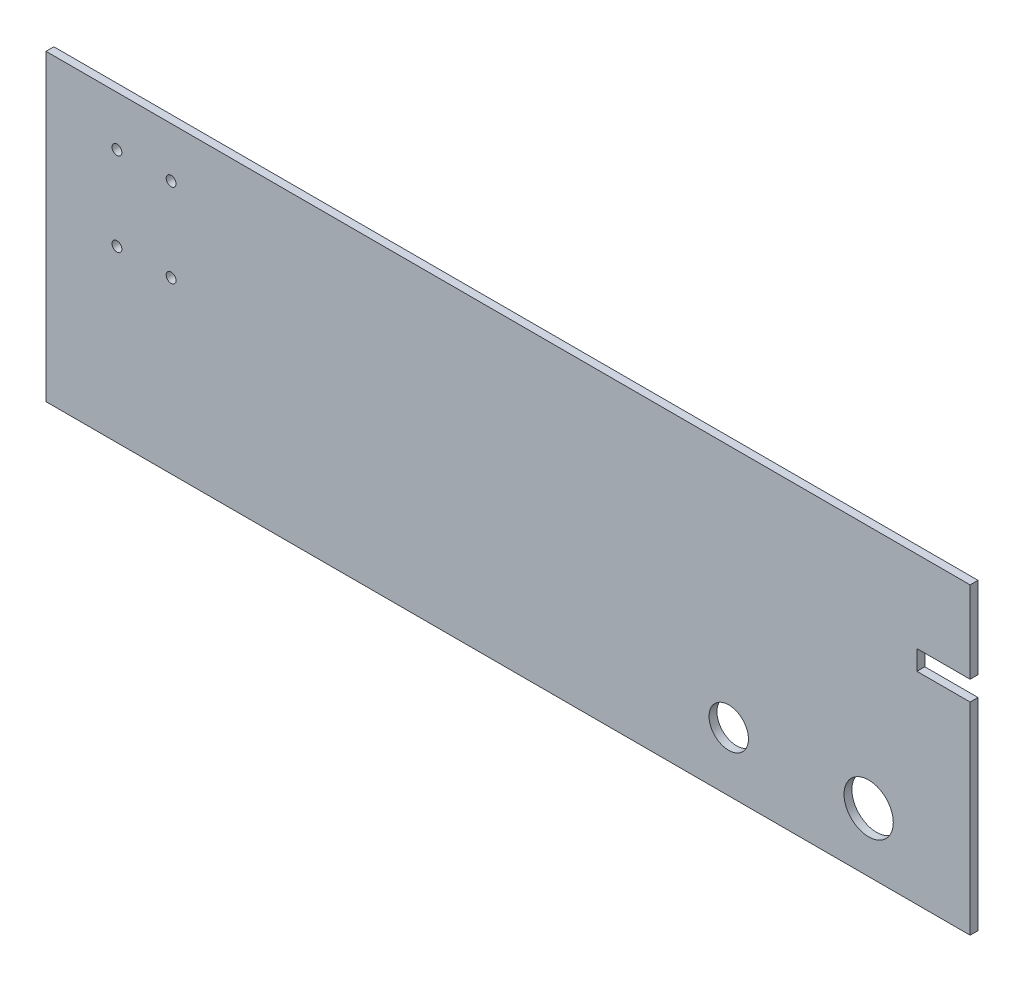
ISO-10303-21;
HEADER;
FILE_DESCRIPTION(('STEP AP214'),'2;1');
FILE_NAME('part.step','',(''),(''),'','','');
FILE_SCHEMA(('AUTOMOTIVE_DESIGN { 1 0 10303 214 1 1 1 1 }'));
ENDSEC;
DATA;
#1=APPLICATION_CONTEXT('core data for automotive mechanical design processes');
#2=APPLICATION_PROTOCOL_DEFINITION('international standard','automotive_design',2000,#1);
#3=PRODUCT_CONTEXT('',#1,'mechanical');
#4=PRODUCT('Part','Part','',(#3));
#5=PRODUCT_RELATED_PRODUCT_CATEGORY('part','',(#4));
#6=PRODUCT_DEFINITION_FORMATION('','',#4);
#7=PRODUCT_DEFINITION_CONTEXT('part definition',#1,'design');
#8=PRODUCT_DEFINITION('design','',#6,#7);
#9=PRODUCT_DEFINITION_SHAPE('','',#8);
#10=(LENGTH_UNIT() NAMED_UNIT(*) SI_UNIT(.MILLI.,.METRE.));
#11=(NAMED_UNIT(*) PLANE_ANGLE_UNIT() SI_UNIT($,.RADIAN.));
#12=(NAMED_UNIT(*) SI_UNIT($,.STERADIAN.) SOLID_ANGLE_UNIT());
#13=UNCERTAINTY_MEASURE_WITH_UNIT(LENGTH_MEASURE(1.E-05),#10,'distance_accuracy_value','');
#14=(GEOMETRIC_REPRESENTATION_CONTEXT(3) GLOBAL_UNCERTAINTY_ASSIGNED_CONTEXT((#13)) GLOBAL_UNIT_ASSIGNED_CONTEXT((#10,
#11,#12)) REPRESENTATION_CONTEXT('',''));
#15=CARTESIAN_POINT('',(0.,0.,0.));
#16=DIRECTION('',(0.,0.,1.));
#17=DIRECTION('',(1.,0.,0.));
#18=AXIS2_PLACEMENT_3D('',#15,#16,#17);
#19=CARTESIAN_POINT('',(-693.,248.,-8.));
#20=DIRECTION('',(-1.,0.,0.));
#21=DIRECTION('',(0.,0.,1.));
#22=AXIS2_PLACEMENT_3D('',#19,#20,#21);
#23=PLANE('',#22);
#24=DIRECTION('',(0.,-1.,0.));
#25=VECTOR('',#24,1.);
#26=CARTESIAN_POINT('',(-693.,248.,0.));
#27=LINE('',#26,#25);
#28=CARTESIAN_POINT('',(-693.,248.,0.));
#29=VERTEX_POINT('',#28);
#30=CARTESIAN_POINT('',(-693.,-60.,0.));
#31=VERTEX_POINT('',#30);
#32=EDGE_CURVE('E99',#29,#31,#27,.T.);
#33=ORIENTED_EDGE('',*,*,#32,.F.);
#34=DIRECTION('',(0.,0.,1.));
#35=VECTOR('',#34,1.);
#36=CARTESIAN_POINT('',(-693.,248.,-8.));
#37=LINE('',#36,#35);
#38=CARTESIAN_POINT('',(-693.,248.,-8.));
#39=VERTEX_POINT('',#38);
#40=EDGE_CURVE('E11',#39,#29,#37,.T.);
#41=ORIENTED_EDGE('',*,*,#40,.F.);
#42=DIRECTION('',(0.,-1.,0.));
#43=VECTOR('',#42,1.);
#44=CARTESIAN_POINT('',(-693.,248.,-8.));
#45=LINE('',#44,#43);
#46=CARTESIAN_POINT('',(-693.,-60.,-8.));
#47=VERTEX_POINT('',#46);
#48=EDGE_CURVE('E101',#39,#47,#45,.T.);
#49=ORIENTED_EDGE('',*,*,#48,.T.);
#50=DIRECTION('',(0.,0.,1.));
#51=VECTOR('',#50,1.);
#52=CARTESIAN_POINT('',(-693.,-60.,-8.));
#53=LINE('',#52,#51);
#54=EDGE_CURVE('E38',#47,#31,#53,.T.);
#55=ORIENTED_EDGE('',*,*,#54,.T.);
#56=EDGE_LOOP('',(#33,#41,#49,#55));
#57=FACE_BOUND('',#56,.T.);
#58=ADVANCED_FACE('F35',(#57),#23,.T.);
#59=CARTESIAN_POINT('',(-693.,248.,-8.));
#60=DIRECTION('',(0.,1.,0.));
#61=DIRECTION('',(0.,0.,1.));
#62=AXIS2_PLACEMENT_3D('',#59,#60,#61);
#63=PLANE('',#62);
#64=DIRECTION('',(-1.,0.,0.));
#65=VECTOR('',#64,1.);
#66=CARTESIAN_POINT('',(-693.,248.,0.));
#67=LINE('',#66,#65);
#68=CARTESIAN_POINT('',(245.,248.,0.));
#69=VERTEX_POINT('',#68);
#70=EDGE_CURVE('E118',#69,#29,#67,.T.);
#71=ORIENTED_EDGE('',*,*,#70,.F.);
#72=DIRECTION('',(0.,0.,1.));
#73=VECTOR('',#72,1.);
#74=CARTESIAN_POINT('',(245.,248.,-8.));
#75=LINE('',#74,#73);
#76=CARTESIAN_POINT('',(245.,248.,-8.));
#77=VERTEX_POINT('',#76);
#78=EDGE_CURVE('E43',#77,#69,#75,.T.);
#79=ORIENTED_EDGE('',*,*,#78,.F.);
#80=DIRECTION('',(-1.,0.,0.));
#81=VECTOR('',#80,1.);
#82=CARTESIAN_POINT('',(-693.,248.,-8.));
#83=LINE('',#82,#81);
#84=EDGE_CURVE('E106',#77,#39,#83,.T.);
#85=ORIENTED_EDGE('',*,*,#84,.T.);
#86=ORIENTED_EDGE('',*,*,#40,.T.);
#87=EDGE_LOOP('',(#71,#79,#85,#86));
#88=FACE_BOUND('',#87,.T.);
#89=ADVANCED_FACE('F184',(#88),#63,.T.);
#90=CARTESIAN_POINT('',(245.,248.,-8.));
#91=DIRECTION('',(1.,0.,0.));
#92=DIRECTION('',(0.,0.,-1.));
#93=AXIS2_PLACEMENT_3D('',#90,#91,#92);
#94=PLANE('',#93);
#95=DIRECTION('',(0.,1.,0.));
#96=VECTOR('',#95,1.);
#97=CARTESIAN_POINT('',(245.,248.,0.));
#98=LINE('',#97,#96);
#99=CARTESIAN_POINT('',(245.,165.,0.));
#100=VERTEX_POINT('',#99);
#101=EDGE_CURVE('E136',#100,#69,#98,.T.);
#102=ORIENTED_EDGE('',*,*,#101,.F.);
#103=DIRECTION('',(0.,0.,1.));
#104=VECTOR('',#103,1.);
#105=CARTESIAN_POINT('',(245.,165.,-8.));
#106=LINE('',#105,#104);
#107=CARTESIAN_POINT('',(245.,165.,-8.));
#108=VERTEX_POINT('',#107);
#109=EDGE_CURVE('E158',#108,#100,#106,.T.);
#110=ORIENTED_EDGE('',*,*,#109,.F.);
#111=DIRECTION('',(0.,1.,0.));
#112=VECTOR('',#111,1.);
#113=CARTESIAN_POINT('',(245.,248.,-8.));
#114=LINE('',#113,#112);
#115=EDGE_CURVE('E154',#108,#77,#114,.T.);
#116=ORIENTED_EDGE('',*,*,#115,.T.);
#117=ORIENTED_EDGE('',*,*,#78,.T.);
#118=EDGE_LOOP('',(#102,#110,#116,#117));
#119=FACE_BOUND('',#118,.T.);
#120=ADVANCED_FACE('F183',(#119),#94,.T.);
#121=CARTESIAN_POINT('',(245.,165.,-8.));
#122=DIRECTION('',(0.,-1.,0.));
#123=DIRECTION('',(0.,0.,-1.));
#124=AXIS2_PLACEMENT_3D('',#121,#122,#123);
#125=PLANE('',#124);
#126=DIRECTION('',(1.,0.,0.));
#127=VECTOR('',#126,1.);
#128=CARTESIAN_POINT('',(245.,165.,0.));
#129=LINE('',#128,#127);
#130=CARTESIAN_POINT('',(191.,165.,0.));
#131=VERTEX_POINT('',#130);
#132=EDGE_CURVE('E133',#131,#100,#129,.T.);
#133=ORIENTED_EDGE('',*,*,#132,.F.);
#134=DIRECTION('',(0.,0.,1.));
#135=VECTOR('',#134,1.);
#136=CARTESIAN_POINT('',(191.,165.,-8.));
#137=LINE('',#136,#135);
#138=CARTESIAN_POINT('',(191.,165.,-8.));
#139=VERTEX_POINT('',#138);
#140=EDGE_CURVE('E160',#139,#131,#137,.T.);
#141=ORIENTED_EDGE('',*,*,#140,.F.);
#142=DIRECTION('',(1.,0.,0.));
#143=VECTOR('',#142,1.);
#144=CARTESIAN_POINT('',(245.,165.,-8.));
#145=LINE('',#144,#143);
#146=EDGE_CURVE('E151',#139,#108,#145,.T.);
#147=ORIENTED_EDGE('',*,*,#146,.T.);
#148=ORIENTED_EDGE('',*,*,#109,.T.);
#149=EDGE_LOOP('',(#133,#141,#147,#148));
#150=FACE_BOUND('',#149,.T.);
#151=ADVANCED_FACE('F179',(#150),#125,.T.);
#152=CARTESIAN_POINT('',(191.,165.,-8.));
#153=DIRECTION('',(1.,0.,0.));
#154=DIRECTION('',(0.,0.,-1.));
#155=AXIS2_PLACEMENT_3D('',#152,#153,#154);
#156=PLANE('',#155);
#157=DIRECTION('',(0.,1.,0.));
#158=VECTOR('',#157,1.);
#159=CARTESIAN_POINT('',(191.,165.,0.));
#160=LINE('',#159,#158);
#161=CARTESIAN_POINT('',(191.,145.,0.));
#162=VERTEX_POINT('',#161);
#163=EDGE_CURVE('E130',#162,#131,#160,.T.);
#164=ORIENTED_EDGE('',*,*,#163,.F.);
#165=DIRECTION('',(0.,0.,1.));
#166=VECTOR('',#165,1.);
#167=CARTESIAN_POINT('',(191.,145.,-8.));
#168=LINE('',#167,#166);
#169=CARTESIAN_POINT('',(191.,145.,-8.));
#170=VERTEX_POINT('',#169);
#171=EDGE_CURVE('E162',#170,#162,#168,.T.);
#172=ORIENTED_EDGE('',*,*,#171,.F.);
#173=DIRECTION('',(0.,1.,0.));
#174=VECTOR('',#173,1.);
#175=CARTESIAN_POINT('',(191.,165.,-8.));
#176=LINE('',#175,#174);
#177=EDGE_CURVE('E148',#170,#139,#176,.T.);
#178=ORIENTED_EDGE('',*,*,#177,.T.);
#179=ORIENTED_EDGE('',*,*,#140,.T.);
#180=EDGE_LOOP('',(#164,#172,#178,#179));
#181=FACE_BOUND('',#180,.T.);
#182=ADVANCED_FACE('F175',(#181),#156,.T.);
#183=CARTESIAN_POINT('',(245.,145.,-8.));
#184=DIRECTION('',(0.,1.,0.));
#185=DIRECTION('',(0.,0.,1.));
#186=AXIS2_PLACEMENT_3D('',#183,#184,#185);
#187=PLANE('',#186);
#188=DIRECTION('',(-1.,0.,0.));
#189=VECTOR('',#188,1.);
#190=CARTESIAN_POINT('',(245.,145.,0.));
#191=LINE('',#190,#189);
#192=CARTESIAN_POINT('',(245.,145.,0.));
#193=VERTEX_POINT('',#192);
#194=EDGE_CURVE('E127',#193,#162,#191,.T.);
#195=ORIENTED_EDGE('',*,*,#194,.F.);
#196=DIRECTION('',(0.,0.,1.));
#197=VECTOR('',#196,1.);
#198=CARTESIAN_POINT('',(245.,145.,-8.));
#199=LINE('',#198,#197);
#200=CARTESIAN_POINT('',(245.,145.,-8.));
#201=VERTEX_POINT('',#200);
#202=EDGE_CURVE('E164',#201,#193,#199,.T.);
#203=ORIENTED_EDGE('',*,*,#202,.F.);
#204=DIRECTION('',(-1.,0.,0.));
#205=VECTOR('',#204,1.);
#206=CARTESIAN_POINT('',(245.,145.,-8.));
#207=LINE('',#206,#205);
#208=EDGE_CURVE('E145',#201,#170,#207,.T.);
#209=ORIENTED_EDGE('',*,*,#208,.T.);
#210=ORIENTED_EDGE('',*,*,#171,.T.);
#211=EDGE_LOOP('',(#195,#203,#209,#210));
#212=FACE_BOUND('',#211,.T.);
#213=ADVANCED_FACE('F171',(#212),#187,.T.);
#214=CARTESIAN_POINT('',(245.,145.,-8.));
#215=DIRECTION('',(1.,0.,0.));
#216=DIRECTION('',(0.,0.,-1.));
#217=AXIS2_PLACEMENT_3D('',#214,#215,#216);
#218=PLANE('',#217);
#219=DIRECTION('',(0.,1.,0.));
#220=VECTOR('',#219,1.);
#221=CARTESIAN_POINT('',(245.,145.,0.));
#222=LINE('',#221,#220);
#223=CARTESIAN_POINT('',(245.,-60.,0.));
#224=VERTEX_POINT('',#223);
#225=EDGE_CURVE('E114',#224,#193,#222,.T.);
#226=ORIENTED_EDGE('',*,*,#225,.F.);
#227=DIRECTION('',(0.,0.,1.));
#228=VECTOR('',#227,1.);
#229=CARTESIAN_POINT('',(245.,-60.,-8.));
#230=LINE('',#229,#228);
#231=CARTESIAN_POINT('',(245.,-60.,-8.));
#232=VERTEX_POINT('',#231);
#233=EDGE_CURVE('E105',#232,#224,#230,.T.);
#234=ORIENTED_EDGE('',*,*,#233,.F.);
#235=DIRECTION('',(0.,1.,0.));
#236=VECTOR('',#235,1.);
#237=CARTESIAN_POINT('',(245.,145.,-8.));
#238=LINE('',#237,#236);
#239=EDGE_CURVE('E142',#232,#201,#238,.T.);
#240=ORIENTED_EDGE('',*,*,#239,.T.);
#241=ORIENTED_EDGE('',*,*,#202,.T.);
#242=EDGE_LOOP('',(#226,#234,#240,#241));
#243=FACE_BOUND('',#242,.T.);
#244=ADVANCED_FACE('F167',(#243),#218,.T.);
#245=CARTESIAN_POINT('',(-693.,-60.,-8.));
#246=DIRECTION('',(0.,-1.,0.));
#247=DIRECTION('',(0.,0.,-1.));
#248=AXIS2_PLACEMENT_3D('',#245,#246,#247);
#249=PLANE('',#248);
#250=DIRECTION('',(1.,0.,0.));
#251=VECTOR('',#250,1.);
#252=CARTESIAN_POINT('',(-693.,-60.,0.));
#253=LINE('',#252,#251);
#254=EDGE_CURVE('E108',#31,#224,#253,.T.);
#255=ORIENTED_EDGE('',*,*,#254,.F.);
#256=ORIENTED_EDGE('',*,*,#54,.F.);
#257=DIRECTION('',(1.,0.,0.));
#258=VECTOR('',#257,1.);
#259=CARTESIAN_POINT('',(-693.,-60.,-8.));
#260=LINE('',#259,#258);
#261=EDGE_CURVE('E140',#47,#232,#260,.T.);
#262=ORIENTED_EDGE('',*,*,#261,.T.);
#263=ORIENTED_EDGE('',*,*,#233,.T.);
#264=EDGE_LOOP('',(#255,#256,#262,#263));
#265=FACE_BOUND('',#264,.T.);
#266=ADVANCED_FACE('F109',(#265),#249,.T.);
#267=CARTESIAN_POINT('',(-693.,-60.,-8.));
#268=DIRECTION('',(0.,0.,1.));
#269=DIRECTION('',(1.,0.,0.));
#270=AXIS2_PLACEMENT_3D('',#267,#268,#269);
#271=PLANE('',#270);
#272=CARTESIAN_POINT('',(142.,0.,-8.));
#273=DIRECTION('',(0.,0.,1.));
#274=DIRECTION('',(1.,0.,0.));
#275=AXIS2_PLACEMENT_3D('',#272,#273,#274);
#276=CIRCLE('',#275,25.);
#277=CARTESIAN_POINT('',(167.,0.,-8.));
#278=VERTEX_POINT('',#277);
#279=EDGE_CURVE('E300',#278,#278,#276,.T.);
#280=ORIENTED_EDGE('',*,*,#279,.T.);
#281=EDGE_LOOP('',(#280));
#282=FACE_BOUND('',#281,.T.);
#283=CARTESIAN_POINT('',(-621.,112.5,-8.));
#284=DIRECTION('',(0.,0.,1.));
#285=DIRECTION('',(-1.,0.,0.));
#286=AXIS2_PLACEMENT_3D('',#283,#284,#285);
#287=CIRCLE('',#286,5.00000000000005);
#288=CARTESIAN_POINT('',(-626.,112.5,-8.));
#289=VERTEX_POINT('',#288);
#290=EDGE_CURVE('E310',#289,#289,#287,.T.);
#291=ORIENTED_EDGE('',*,*,#290,.T.);
#292=EDGE_LOOP('',(#291));
#293=FACE_BOUND('',#292,.T.);
#294=CARTESIAN_POINT('',(-566.,112.5,-8.));
#295=DIRECTION('',(0.,0.,1.));
#296=DIRECTION('',(1.,0.,0.));
#297=AXIS2_PLACEMENT_3D('',#294,#295,#296);
#298=CIRCLE('',#297,5.00000000000005);
#299=CARTESIAN_POINT('',(-561.,112.5,-8.));
#300=VERTEX_POINT('',#299);
#301=EDGE_CURVE('E316',#300,#300,#298,.T.);
#302=ORIENTED_EDGE('',*,*,#301,.T.);
#303=EDGE_LOOP('',(#302));
#304=FACE_BOUND('',#303,.T.);
#305=CARTESIAN_POINT('',(-566.,197.5,-8.));
#306=DIRECTION('',(0.,0.,1.));
#307=DIRECTION('',(-1.,0.,0.));
#308=AXIS2_PLACEMENT_3D('',#305,#306,#307);
#309=CIRCLE('',#308,5.00000000000005);
#310=CARTESIAN_POINT('',(-571.,197.5,-8.));
#311=VERTEX_POINT('',#310);
#312=EDGE_CURVE('E322',#311,#311,#309,.T.);
#313=ORIENTED_EDGE('',*,*,#312,.T.);
#314=EDGE_LOOP('',(#313));
#315=FACE_BOUND('',#314,.T.);
#316=CARTESIAN_POINT('',(-621.,197.5,-8.));
#317=DIRECTION('',(0.,0.,1.));
#318=DIRECTION('',(1.,0.,0.));
#319=AXIS2_PLACEMENT_3D('',#316,#317,#318);
#320=CIRCLE('',#319,5.00000000000005);
#321=CARTESIAN_POINT('',(-616.,197.5,-8.));
#322=VERTEX_POINT('',#321);
#323=EDGE_CURVE('E328',#322,#322,#320,.T.);
#324=ORIENTED_EDGE('',*,*,#323,.T.);
#325=EDGE_LOOP('',(#324));
#326=FACE_BOUND('',#325,.T.);
#327=CARTESIAN_POINT('',(0.,0.,-8.));
#328=DIRECTION('',(0.,0.,1.));
#329=DIRECTION('',(1.,0.,0.));
#330=AXIS2_PLACEMENT_3D('',#327,#328,#329);
#331=CIRCLE('',#330,20.);
#332=CARTESIAN_POINT('',(20.,0.,-8.));
#333=VERTEX_POINT('',#332);
#334=EDGE_CURVE('E119',#333,#333,#331,.T.);
#335=ORIENTED_EDGE('',*,*,#334,.T.);
#336=EDGE_LOOP('',(#335));
#337=FACE_BOUND('',#336,.T.);
#338=ORIENTED_EDGE('',*,*,#48,.F.);
#339=ORIENTED_EDGE('',*,*,#84,.F.);
#340=ORIENTED_EDGE('',*,*,#115,.F.);
#341=ORIENTED_EDGE('',*,*,#146,.F.);
#342=ORIENTED_EDGE('',*,*,#177,.F.);
#343=ORIENTED_EDGE('',*,*,#208,.F.);
#344=ORIENTED_EDGE('',*,*,#239,.F.);
#345=ORIENTED_EDGE('',*,*,#261,.F.);
#346=EDGE_LOOP('',(#338,#339,#340,#341,#342,#343,#344,#345));
#347=FACE_BOUND('',#346,.T.);
#348=ADVANCED_FACE('F187',(#282,#293,#304,#315,#326,#337,#347),#271,.F.);
#349=CARTESIAN_POINT('',(-693.,-60.,0.));
#350=DIRECTION('',(0.,0.,1.));
#351=DIRECTION('',(1.,0.,0.));
#352=AXIS2_PLACEMENT_3D('',#349,#350,#351);
#353=PLANE('',#352);
#354=CARTESIAN_POINT('',(142.,0.,0.));
#355=DIRECTION('',(0.,0.,1.));
#356=DIRECTION('',(1.,0.,0.));
#357=AXIS2_PLACEMENT_3D('',#354,#355,#356);
#358=CIRCLE('',#357,25.);
#359=CARTESIAN_POINT('',(167.,0.,0.));
#360=VERTEX_POINT('',#359);
#361=EDGE_CURVE('E303',#360,#360,#358,.T.);
#362=ORIENTED_EDGE('',*,*,#361,.F.);
#363=EDGE_LOOP('',(#362));
#364=FACE_BOUND('',#363,.T.);
#365=CARTESIAN_POINT('',(-621.,112.5,0.));
#366=DIRECTION('',(0.,0.,1.));
#367=DIRECTION('',(-1.,0.,0.));
#368=AXIS2_PLACEMENT_3D('',#365,#366,#367);
#369=CIRCLE('',#368,5.00000000000005);
#370=CARTESIAN_POINT('',(-626.,112.5,0.));
#371=VERTEX_POINT('',#370);
#372=EDGE_CURVE('E305',#371,#371,#369,.T.);
#373=ORIENTED_EDGE('',*,*,#372,.F.);
#374=EDGE_LOOP('',(#373));
#375=FACE_BOUND('',#374,.T.);
#376=CARTESIAN_POINT('',(-566.,112.5,0.));
#377=DIRECTION('',(0.,0.,1.));
#378=DIRECTION('',(1.,0.,0.));
#379=AXIS2_PLACEMENT_3D('',#376,#377,#378);
#380=CIRCLE('',#379,5.00000000000005);
#381=CARTESIAN_POINT('',(-561.,112.5,0.));
#382=VERTEX_POINT('',#381);
#383=EDGE_CURVE('E313',#382,#382,#380,.T.);
#384=ORIENTED_EDGE('',*,*,#383,.F.);
#385=EDGE_LOOP('',(#384));
#386=FACE_BOUND('',#385,.T.);
#387=CARTESIAN_POINT('',(-566.,197.5,0.));
#388=DIRECTION('',(0.,0.,1.));
#389=DIRECTION('',(-1.,0.,0.));
#390=AXIS2_PLACEMENT_3D('',#387,#388,#389);
#391=CIRCLE('',#390,5.00000000000005);
#392=CARTESIAN_POINT('',(-571.,197.5,0.));
#393=VERTEX_POINT('',#392);
#394=EDGE_CURVE('E319',#393,#393,#391,.T.);
#395=ORIENTED_EDGE('',*,*,#394,.F.);
#396=EDGE_LOOP('',(#395));
#397=FACE_BOUND('',#396,.T.);
#398=CARTESIAN_POINT('',(-621.,197.5,0.));
#399=DIRECTION('',(0.,0.,1.));
#400=DIRECTION('',(1.,0.,0.));
#401=AXIS2_PLACEMENT_3D('',#398,#399,#400);
#402=CIRCLE('',#401,5.00000000000005);
#403=CARTESIAN_POINT('',(-616.,197.5,0.));
#404=VERTEX_POINT('',#403);
#405=EDGE_CURVE('E325',#404,#404,#402,.T.);
#406=ORIENTED_EDGE('',*,*,#405,.F.);
#407=EDGE_LOOP('',(#406));
#408=FACE_BOUND('',#407,.T.);
#409=CARTESIAN_POINT('',(0.,0.,0.));
#410=DIRECTION('',(0.,0.,1.));
#411=DIRECTION('',(1.,0.,0.));
#412=AXIS2_PLACEMENT_3D('',#409,#410,#411);
#413=CIRCLE('',#412,20.);
#414=CARTESIAN_POINT('',(20.,0.,0.));
#415=VERTEX_POINT('',#414);
#416=EDGE_CURVE('E122',#415,#415,#413,.T.);
#417=ORIENTED_EDGE('',*,*,#416,.F.);
#418=EDGE_LOOP('',(#417));
#419=FACE_BOUND('',#418,.T.);
#420=ORIENTED_EDGE('',*,*,#32,.T.);
#421=ORIENTED_EDGE('',*,*,#254,.T.);
#422=ORIENTED_EDGE('',*,*,#225,.T.);
#423=ORIENTED_EDGE('',*,*,#194,.T.);
#424=ORIENTED_EDGE('',*,*,#163,.T.);
#425=ORIENTED_EDGE('',*,*,#132,.T.);
#426=ORIENTED_EDGE('',*,*,#101,.T.);
#427=ORIENTED_EDGE('',*,*,#70,.T.);
#428=EDGE_LOOP('',(#420,#421,#422,#423,#424,#425,#426,#427));
#429=FACE_BOUND('',#428,.T.);
#430=ADVANCED_FACE('F116',(#364,#375,#386,#397,#408,#419,#429),#353,.T.);
#431=CARTESIAN_POINT('',(0.,0.,-8.));
#432=DIRECTION('',(0.,0.,1.));
#433=DIRECTION('',(1.,0.,0.));
#434=AXIS2_PLACEMENT_3D('',#431,#432,#433);
#435=CYLINDRICAL_SURFACE('',#434,20.);
#436=ORIENTED_EDGE('',*,*,#334,.F.);
#437=EDGE_LOOP('',(#436));
#438=FACE_BOUND('',#437,.T.);
#439=ORIENTED_EDGE('',*,*,#416,.T.);
#440=EDGE_LOOP('',(#439));
#441=FACE_BOUND('',#440,.T.);
#442=ADVANCED_FACE('F195',(#438,#441),#435,.F.);
#443=CARTESIAN_POINT('',(-621.,197.5,-8.));
#444=DIRECTION('',(0.,0.,1.));
#445=DIRECTION('',(1.,0.,0.));
#446=AXIS2_PLACEMENT_3D('',#443,#444,#445);
#447=CYLINDRICAL_SURFACE('',#446,5.00000000000005);
#448=ORIENTED_EDGE('',*,*,#323,.F.);
#449=EDGE_LOOP('',(#448));
#450=FACE_BOUND('',#449,.T.);
#451=ORIENTED_EDGE('',*,*,#405,.T.);
#452=EDGE_LOOP('',(#451));
#453=FACE_BOUND('',#452,.T.);
#454=ADVANCED_FACE('F244',(#450,#453),#447,.F.);
#455=CARTESIAN_POINT('',(-566.,197.5,-8.));
#456=DIRECTION('',(0.,0.,1.));
#457=DIRECTION('',(1.,0.,0.));
#458=AXIS2_PLACEMENT_3D('',#455,#456,#457);
#459=CYLINDRICAL_SURFACE('',#458,5.00000000000005);
#460=ORIENTED_EDGE('',*,*,#312,.F.);
#461=EDGE_LOOP('',(#460));
#462=FACE_BOUND('',#461,.T.);
#463=ORIENTED_EDGE('',*,*,#394,.T.);
#464=EDGE_LOOP('',(#463));
#465=FACE_BOUND('',#464,.T.);
#466=ADVANCED_FACE('F254',(#462,#465),#459,.F.);
#467=CARTESIAN_POINT('',(-566.,112.5,-8.));
#468=DIRECTION('',(0.,0.,1.));
#469=DIRECTION('',(1.,0.,0.));
#470=AXIS2_PLACEMENT_3D('',#467,#468,#469);
#471=CYLINDRICAL_SURFACE('',#470,5.00000000000005);
#472=ORIENTED_EDGE('',*,*,#301,.F.);
#473=EDGE_LOOP('',(#472));
#474=FACE_BOUND('',#473,.T.);
#475=ORIENTED_EDGE('',*,*,#383,.T.);
#476=EDGE_LOOP('',(#475));
#477=FACE_BOUND('',#476,.T.);
#478=ADVANCED_FACE('F264',(#474,#477),#471,.F.);
#479=CARTESIAN_POINT('',(-621.,112.5,-8.));
#480=DIRECTION('',(0.,0.,1.));
#481=DIRECTION('',(1.,0.,0.));
#482=AXIS2_PLACEMENT_3D('',#479,#480,#481);
#483=CYLINDRICAL_SURFACE('',#482,5.00000000000005);
#484=ORIENTED_EDGE('',*,*,#290,.F.);
#485=EDGE_LOOP('',(#484));
#486=FACE_BOUND('',#485,.T.);
#487=ORIENTED_EDGE('',*,*,#372,.T.);
#488=EDGE_LOOP('',(#487));
#489=FACE_BOUND('',#488,.T.);
#490=ADVANCED_FACE('F274',(#486,#489),#483,.F.);
#491=CARTESIAN_POINT('',(142.,0.,-8.));
#492=DIRECTION('',(0.,0.,1.));
#493=DIRECTION('',(1.,0.,0.));
#494=AXIS2_PLACEMENT_3D('',#491,#492,#493);
#495=CYLINDRICAL_SURFACE('',#494,25.);
#496=ORIENTED_EDGE('',*,*,#279,.F.);
#497=EDGE_LOOP('',(#496));
#498=FACE_BOUND('',#497,.T.);
#499=ORIENTED_EDGE('',*,*,#361,.T.);
#500=EDGE_LOOP('',(#499));
#501=FACE_BOUND('',#500,.T.);
#502=ADVANCED_FACE('F284',(#498,#501),#495,.F.);
#503=CLOSED_SHELL('',(#58,#89,#120,#151,#182,#213,#244,#266,#348,#430,#442,#454,#466,#478,#490,#502));
#504=MANIFOLD_SOLID_BREP('B2',#503);
#505=ADVANCED_BREP_SHAPE_REPRESENTATION('',(#18,#504),#14);
#506=SHAPE_DEFINITION_REPRESENTATION(#9,#505);
ENDSEC;
END-ISO-10303-21;
